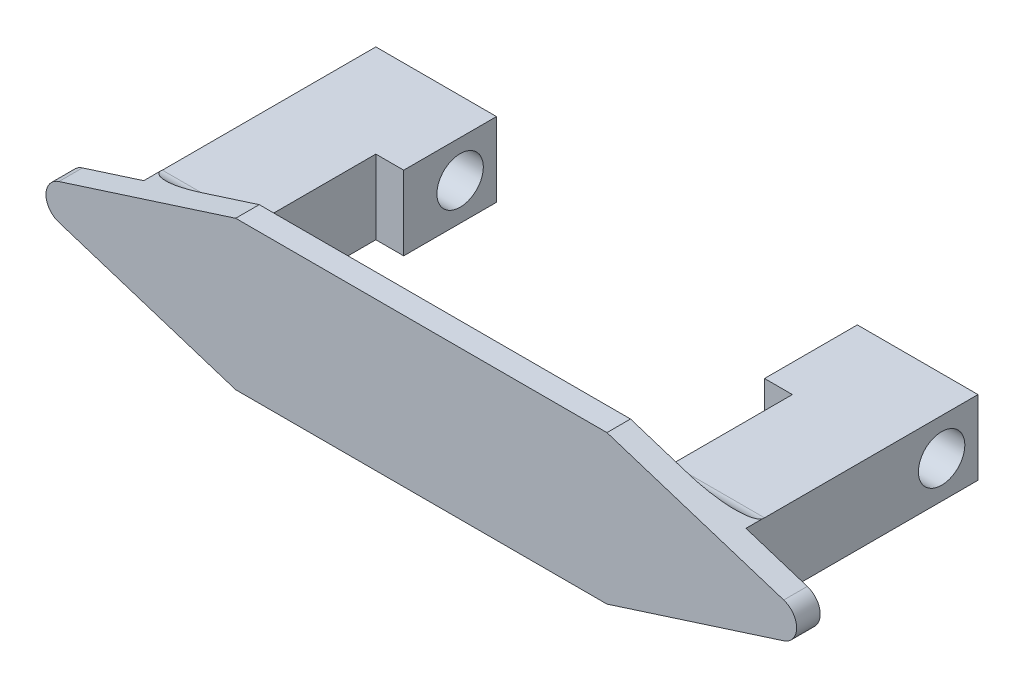
ISO-10303-21;
HEADER;
FILE_DESCRIPTION(('STEP AP214'),'2;1');
FILE_NAME('part.step','',(''),(''),'','','');
FILE_SCHEMA(('AUTOMOTIVE_DESIGN { 1 0 10303 214 1 1 1 1 }'));
ENDSEC;
DATA;
#1=APPLICATION_CONTEXT('core data for automotive mechanical design processes');
#2=APPLICATION_PROTOCOL_DEFINITION('international standard','automotive_design',2000,#1);
#3=PRODUCT_CONTEXT('',#1,'mechanical');
#4=PRODUCT('Part','Part','',(#3));
#5=PRODUCT_RELATED_PRODUCT_CATEGORY('part','',(#4));
#6=PRODUCT_DEFINITION_FORMATION('','',#4);
#7=PRODUCT_DEFINITION_CONTEXT('part definition',#1,'design');
#8=PRODUCT_DEFINITION('design','',#6,#7);
#9=PRODUCT_DEFINITION_SHAPE('','',#8);
#10=(LENGTH_UNIT() NAMED_UNIT(*) SI_UNIT(.MILLI.,.METRE.));
#11=(NAMED_UNIT(*) PLANE_ANGLE_UNIT() SI_UNIT($,.RADIAN.));
#12=(NAMED_UNIT(*) SI_UNIT($,.STERADIAN.) SOLID_ANGLE_UNIT());
#13=UNCERTAINTY_MEASURE_WITH_UNIT(LENGTH_MEASURE(1.E-05),#10,'distance_accuracy_value','');
#14=(GEOMETRIC_REPRESENTATION_CONTEXT(3) GLOBAL_UNCERTAINTY_ASSIGNED_CONTEXT((#13)) GLOBAL_UNIT_ASSIGNED_CONTEXT((#10,
#11,#12)) REPRESENTATION_CONTEXT('',''));
#15=CARTESIAN_POINT('',(0.,0.,0.));
#16=DIRECTION('',(0.,0.,1.));
#17=DIRECTION('',(1.,0.,0.));
#18=AXIS2_PLACEMENT_3D('',#15,#16,#17);
#19=CARTESIAN_POINT('',(0.,0.,-1.27));
#20=DIRECTION('',(0.,0.,-1.));
#21=DIRECTION('',(-1.,0.,0.));
#22=AXIS2_PLACEMENT_3D('',#19,#20,#21);
#23=PLANE('',#22);
#24=DIRECTION('',(0.952424147199324,0.304775727103784,0.));
#25=VECTOR('',#24,1.);
#26=CARTESIAN_POINT('',(45.,0.,-1.27));
#27=LINE('',#26,#25);
#28=CARTESIAN_POINT('',(32.4377976257967,-4.01990475974506,-1.27));
#29=VERTEX_POINT('',#28);
#30=CARTESIAN_POINT('',(39.0473490800042,-1.90484829439864,-1.27));
#31=VERTEX_POINT('',#30);
#32=EDGE_CURVE('E312',#29,#31,#27,.T.);
#33=ORIENTED_EDGE('',*,*,#32,.F.);
#34=DIRECTION('',(0.,-1.,0.));
#35=VECTOR('',#34,1.);
#36=CARTESIAN_POINT('',(32.4377976257967,4.,-1.27));
#37=LINE('',#36,#35);
#38=CARTESIAN_POINT('',(32.4377976257967,4.01990475974507,-1.27));
#39=VERTEX_POINT('',#38);
#40=EDGE_CURVE('E249',#39,#29,#37,.T.);
#41=ORIENTED_EDGE('',*,*,#40,.F.);
#42=DIRECTION('',(-0.952424147199324,0.304775727103784,0.));
#43=VECTOR('',#42,1.);
#44=CARTESIAN_POINT('',(45.,0.,-1.27));
#45=LINE('',#44,#43);
#46=CARTESIAN_POINT('',(39.0473490800042,1.90484829439866,-1.27));
#47=VERTEX_POINT('',#46);
#48=EDGE_CURVE('E316',#47,#39,#45,.T.);
#49=ORIENTED_EDGE('',*,*,#48,.F.);
#50=CARTESIAN_POINT('',(38.4377976257967,0.,-1.27));
#51=DIRECTION('',(0.,0.,-1.));
#52=DIRECTION('',(-1.,0.,0.));
#53=AXIS2_PLACEMENT_3D('',#50,#51,#52);
#54=CIRCLE('',#53,2.);
#55=EDGE_CURVE('E340',#47,#31,#54,.T.);
#56=ORIENTED_EDGE('',*,*,#55,.T.);
#57=EDGE_LOOP('',(#33,#41,#49,#56));
#58=FACE_BOUND('',#57,.T.);
#59=ADVANCED_FACE('F33',(#58),#23,.T.);
#60=DIRECTION('',(0.,-1.,0.));
#61=VECTOR('',#60,1.);
#62=CARTESIAN_POINT('',(-32.4377976257967,4.,-1.27));
#63=LINE('',#62,#61);
#64=CARTESIAN_POINT('',(-32.4377976257967,4.01990475974507,-1.27));
#65=VERTEX_POINT('',#64);
#66=CARTESIAN_POINT('',(-32.4377976257967,-4.01990475974507,-1.27));
#67=VERTEX_POINT('',#66);
#68=EDGE_CURVE('E268',#65,#67,#63,.T.);
#69=ORIENTED_EDGE('',*,*,#68,.T.);
#70=DIRECTION('',(0.952424147199324,-0.304775727103784,0.));
#71=VECTOR('',#70,1.);
#72=CARTESIAN_POINT('',(-45.,0.,-1.27));
#73=LINE('',#72,#71);
#74=CARTESIAN_POINT('',(-39.0473490800042,-1.90484829439865,-1.27));
#75=VERTEX_POINT('',#74);
#76=EDGE_CURVE('E307',#75,#67,#73,.T.);
#77=ORIENTED_EDGE('',*,*,#76,.F.);
#78=CARTESIAN_POINT('',(-38.4377976257967,0.,-1.27));
#79=DIRECTION('',(0.,0.,-1.));
#80=DIRECTION('',(-1.,0.,0.));
#81=AXIS2_PLACEMENT_3D('',#78,#79,#80);
#82=CIRCLE('',#81,2.);
#83=CARTESIAN_POINT('',(-39.0473490800042,1.90484829439865,-1.27));
#84=VERTEX_POINT('',#83);
#85=EDGE_CURVE('E337',#75,#84,#82,.T.);
#86=ORIENTED_EDGE('',*,*,#85,.T.);
#87=DIRECTION('',(-0.952424147199324,-0.304775727103784,0.));
#88=VECTOR('',#87,1.);
#89=CARTESIAN_POINT('',(-45.,0.,-1.27));
#90=LINE('',#89,#88);
#91=EDGE_CURVE('E321',#65,#84,#90,.T.);
#92=ORIENTED_EDGE('',*,*,#91,.F.);
#93=EDGE_LOOP('',(#69,#77,#86,#92));
#94=FACE_BOUND('',#93,.T.);
#95=ADVANCED_FACE('F492',(#94),#23,.T.);
#96=DIRECTION('',(0.,-1.,0.));
#97=VECTOR('',#96,1.);
#98=CARTESIAN_POINT('',(20.4377976257967,0.,-1.27));
#99=LINE('',#98,#97);
#100=CARTESIAN_POINT('',(20.4377976257967,6.,-1.27));
#101=VERTEX_POINT('',#100);
#102=CARTESIAN_POINT('',(20.4377976257967,-6.,-1.27));
#103=VERTEX_POINT('',#102);
#104=EDGE_CURVE('E367',#101,#103,#99,.T.);
#105=ORIENTED_EDGE('',*,*,#104,.T.);
#106=DIRECTION('',(1.,0.,0.));
#107=VECTOR('',#106,1.);
#108=CARTESIAN_POINT('',(32.4377976257967,-6.,-1.27));
#109=LINE('',#108,#107);
#110=CARTESIAN_POINT('',(26.25,-6.,-1.27));
#111=VERTEX_POINT('',#110);
#112=EDGE_CURVE('E369',#103,#111,#109,.T.);
#113=ORIENTED_EDGE('',*,*,#112,.T.);
#114=CARTESIAN_POINT('',(20.,-8.,-1.27));
#115=VERTEX_POINT('',#114);
#116=EDGE_CURVE('E313',#115,#111,#27,.T.);
#117=ORIENTED_EDGE('',*,*,#116,.F.);
#118=DIRECTION('',(1.,0.,0.));
#119=VECTOR('',#118,1.);
#120=CARTESIAN_POINT('',(-20.,-8.00000000000001,-1.27));
#121=LINE('',#120,#119);
#122=CARTESIAN_POINT('',(-20.,-8.00000000000001,-1.27));
#123=VERTEX_POINT('',#122);
#124=EDGE_CURVE('E310',#123,#115,#121,.T.);
#125=ORIENTED_EDGE('',*,*,#124,.F.);
#126=CARTESIAN_POINT('',(-26.25,-6.,-1.27));
#127=VERTEX_POINT('',#126);
#128=EDGE_CURVE('E290',#127,#123,#73,.T.);
#129=ORIENTED_EDGE('',*,*,#128,.F.);
#130=DIRECTION('',(1.,0.,0.));
#131=VECTOR('',#130,1.);
#132=CARTESIAN_POINT('',(-22.4377976257967,-6.,-1.27));
#133=LINE('',#132,#131);
#134=CARTESIAN_POINT('',(-20.4377976257967,-6.,-1.27));
#135=VERTEX_POINT('',#134);
#136=EDGE_CURVE('E363',#127,#135,#133,.T.);
#137=ORIENTED_EDGE('',*,*,#136,.T.);
#138=DIRECTION('',(0.,-1.,0.));
#139=VECTOR('',#138,1.);
#140=CARTESIAN_POINT('',(-20.4377976257967,0.,-1.27));
#141=LINE('',#140,#139);
#142=CARTESIAN_POINT('',(-20.4377976257967,6.,-1.27));
#143=VERTEX_POINT('',#142);
#144=EDGE_CURVE('E354',#135,#143,#141,.F.);
#145=ORIENTED_EDGE('',*,*,#144,.T.);
#146=DIRECTION('',(1.,0.,0.));
#147=VECTOR('',#146,1.);
#148=CARTESIAN_POINT('',(0.,6.,-1.27));
#149=LINE('',#148,#147);
#150=CARTESIAN_POINT('',(-26.25,6.,-1.27));
#151=VERTEX_POINT('',#150);
#152=EDGE_CURVE('E361',#143,#151,#149,.F.);
#153=ORIENTED_EDGE('',*,*,#152,.T.);
#154=CARTESIAN_POINT('',(-20.,8.,-1.27));
#155=VERTEX_POINT('',#154);
#156=EDGE_CURVE('E294',#155,#151,#90,.T.);
#157=ORIENTED_EDGE('',*,*,#156,.F.);
#158=DIRECTION('',(-1.,0.,0.));
#159=VECTOR('',#158,1.);
#160=CARTESIAN_POINT('',(-20.,8.,-1.27));
#161=LINE('',#160,#159);
#162=CARTESIAN_POINT('',(20.,8.,-1.27));
#163=VERTEX_POINT('',#162);
#164=EDGE_CURVE('E319',#163,#155,#161,.T.);
#165=ORIENTED_EDGE('',*,*,#164,.F.);
#166=CARTESIAN_POINT('',(26.25,6.00000000000001,-1.27));
#167=VERTEX_POINT('',#166);
#168=EDGE_CURVE('E315',#167,#163,#45,.T.);
#169=ORIENTED_EDGE('',*,*,#168,.F.);
#170=DIRECTION('',(1.,0.,0.));
#171=VECTOR('',#170,1.);
#172=CARTESIAN_POINT('',(0.,6.,-1.27));
#173=LINE('',#172,#171);
#174=EDGE_CURVE('E365',#167,#101,#173,.F.);
#175=ORIENTED_EDGE('',*,*,#174,.T.);
#176=EDGE_LOOP('',(#105,#113,#117,#125,#129,#137,#145,#153,#157,#165,#169,#175));
#177=FACE_BOUND('',#176,.T.);
#178=ADVANCED_FACE('F426',(#177),#23,.T.);
#179=CARTESIAN_POINT('',(-45.,0.,1.27));
#180=DIRECTION('',(0.304775727103784,0.952424147199324,0.));
#181=DIRECTION('',(-0.952424147199324,0.304775727103784,0.));
#182=AXIS2_PLACEMENT_3D('',#179,#180,#181);
#183=PLANE('',#182);
#184=DIRECTION('',(0.952424147199324,-0.304775727103784,0.));
#185=VECTOR('',#184,1.);
#186=CARTESIAN_POINT('',(-45.,0.,1.27));
#187=LINE('',#186,#185);
#188=CARTESIAN_POINT('',(-39.0473490800042,-1.90484829439865,1.27));
#189=VERTEX_POINT('',#188);
#190=CARTESIAN_POINT('',(-20.,-8.00000000000001,1.27));
#191=VERTEX_POINT('',#190);
#192=EDGE_CURVE('E291',#189,#191,#187,.T.);
#193=ORIENTED_EDGE('',*,*,#192,.F.);
#194=DIRECTION('',(0.,0.,-1.));
#195=VECTOR('',#194,1.);
#196=CARTESIAN_POINT('',(-39.0473490800042,-1.90484829439865,1.27));
#197=LINE('',#196,#195);
#198=EDGE_CURVE('E349',#189,#75,#197,.T.);
#199=ORIENTED_EDGE('',*,*,#198,.T.);
#200=ORIENTED_EDGE('',*,*,#76,.T.);
#201=DIRECTION('',(0.,0.,-1.));
#202=VECTOR('',#201,1.);
#203=CARTESIAN_POINT('',(-32.4377976257967,-4.01990475974507,1.27));
#204=LINE('',#203,#202);
#205=CARTESIAN_POINT('',(-32.4377976257967,-4.01990475974507,-2.98853447898582));
#206=VERTEX_POINT('',#205);
#207=EDGE_CURVE('E400',#67,#206,#204,.T.);
#208=ORIENTED_EDGE('',*,*,#207,.T.);
#209=CARTESIAN_POINT('',(-26.25,-6.,-3.27));
#210=DIRECTION('',(0.304775727103784,0.952424147199324,0.));
#211=DIRECTION('',(-0.952424147199324,0.304775727103784,0.));
#212=AXIS2_PLACEMENT_3D('',#209,#210,#211);
#213=ELLIPSE('',#212,6.56220237420334,2.);
#214=EDGE_CURVE('E390',#206,#127,#213,.T.);
#215=ORIENTED_EDGE('',*,*,#214,.T.);
#216=ORIENTED_EDGE('',*,*,#128,.T.);
#217=DIRECTION('',(0.,0.,-1.));
#218=VECTOR('',#217,1.);
#219=CARTESIAN_POINT('',(-20.,-8.00000000000001,1.27));
#220=LINE('',#219,#218);
#221=EDGE_CURVE('E331',#191,#123,#220,.T.);
#222=ORIENTED_EDGE('',*,*,#221,.F.);
#223=EDGE_LOOP('',(#193,#199,#200,#208,#215,#216,#222));
#224=FACE_BOUND('',#223,.T.);
#225=ADVANCED_FACE('F461',(#224),#183,.F.);
#226=CARTESIAN_POINT('',(-20.,-8.00000000000001,1.27));
#227=DIRECTION('',(0.,1.,0.));
#228=DIRECTION('',(-1.,0.,0.));
#229=AXIS2_PLACEMENT_3D('',#226,#227,#228);
#230=PLANE('',#229);
#231=ORIENTED_EDGE('',*,*,#124,.T.);
#232=DIRECTION('',(0.,0.,-1.));
#233=VECTOR('',#232,1.);
#234=CARTESIAN_POINT('',(20.,-8.,1.27));
#235=LINE('',#234,#233);
#236=CARTESIAN_POINT('',(20.,-8.,1.27));
#237=VERTEX_POINT('',#236);
#238=EDGE_CURVE('E328',#237,#115,#235,.T.);
#239=ORIENTED_EDGE('',*,*,#238,.F.);
#240=DIRECTION('',(1.,0.,0.));
#241=VECTOR('',#240,1.);
#242=CARTESIAN_POINT('',(-20.,-8.00000000000001,1.27));
#243=LINE('',#242,#241);
#244=EDGE_CURVE('E293',#191,#237,#243,.T.);
#245=ORIENTED_EDGE('',*,*,#244,.F.);
#246=ORIENTED_EDGE('',*,*,#221,.T.);
#247=EDGE_LOOP('',(#231,#239,#245,#246));
#248=FACE_BOUND('',#247,.T.);
#249=ADVANCED_FACE('F456',(#248),#230,.F.);
#250=CARTESIAN_POINT('',(45.,0.,1.27));
#251=DIRECTION('',(-0.304775727103784,0.952424147199324,0.));
#252=DIRECTION('',(-0.952424147199324,-0.304775727103784,0.));
#253=AXIS2_PLACEMENT_3D('',#250,#251,#252);
#254=PLANE('',#253);
#255=ORIENTED_EDGE('',*,*,#116,.T.);
#256=CARTESIAN_POINT('',(26.25,-6.,-3.27));
#257=DIRECTION('',(-0.304775727103784,0.952424147199324,0.));
#258=DIRECTION('',(-0.952424147199324,-0.304775727103784,0.));
#259=AXIS2_PLACEMENT_3D('',#256,#257,#258);
#260=ELLIPSE('',#259,6.56220237420334,2.);
#261=CARTESIAN_POINT('',(32.4377976257967,-4.01990475974506,-2.98853447898589));
#262=VERTEX_POINT('',#261);
#263=EDGE_CURVE('E57',#111,#262,#260,.T.);
#264=ORIENTED_EDGE('',*,*,#263,.T.);
#265=DIRECTION('',(0.,0.,1.));
#266=VECTOR('',#265,1.);
#267=CARTESIAN_POINT('',(32.4377976257967,-4.01990475974506,1.27));
#268=LINE('',#267,#266);
#269=EDGE_CURVE('E42',#29,#262,#268,.F.);
#270=ORIENTED_EDGE('',*,*,#269,.F.);
#271=ORIENTED_EDGE('',*,*,#32,.T.);
#272=DIRECTION('',(0.,0.,-1.));
#273=VECTOR('',#272,1.);
#274=CARTESIAN_POINT('',(39.0473490800042,-1.90484829439864,1.27));
#275=LINE('',#274,#273);
#276=CARTESIAN_POINT('',(39.0473490800042,-1.90484829439864,1.27));
#277=VERTEX_POINT('',#276);
#278=EDGE_CURVE('E343',#31,#277,#275,.F.);
#279=ORIENTED_EDGE('',*,*,#278,.T.);
#280=DIRECTION('',(0.952424147199324,0.304775727103784,0.));
#281=VECTOR('',#280,1.);
#282=CARTESIAN_POINT('',(45.,0.,1.27));
#283=LINE('',#282,#281);
#284=EDGE_CURVE('E296',#237,#277,#283,.T.);
#285=ORIENTED_EDGE('',*,*,#284,.F.);
#286=ORIENTED_EDGE('',*,*,#238,.T.);
#287=EDGE_LOOP('',(#255,#264,#270,#271,#279,#285,#286));
#288=FACE_BOUND('',#287,.T.);
#289=ADVANCED_FACE('F451',(#288),#254,.F.);
#290=CARTESIAN_POINT('',(45.,0.,1.27));
#291=DIRECTION('',(-0.304775727103784,-0.952424147199324,0.));
#292=DIRECTION('',(0.952424147199324,-0.304775727103784,0.));
#293=AXIS2_PLACEMENT_3D('',#290,#291,#292);
#294=PLANE('',#293);
#295=DIRECTION('',(-0.952424147199324,0.304775727103784,0.));
#296=VECTOR('',#295,1.);
#297=CARTESIAN_POINT('',(45.,0.,1.27));
#298=LINE('',#297,#296);
#299=CARTESIAN_POINT('',(39.0473490800042,1.90484829439866,1.27));
#300=VERTEX_POINT('',#299);
#301=CARTESIAN_POINT('',(20.,8.,1.27));
#302=VERTEX_POINT('',#301);
#303=EDGE_CURVE('E299',#300,#302,#298,.T.);
#304=ORIENTED_EDGE('',*,*,#303,.F.);
#305=DIRECTION('',(0.,0.,-1.));
#306=VECTOR('',#305,1.);
#307=CARTESIAN_POINT('',(39.0473490800042,1.90484829439866,1.27));
#308=LINE('',#307,#306);
#309=EDGE_CURVE('E334',#300,#47,#308,.T.);
#310=ORIENTED_EDGE('',*,*,#309,.T.);
#311=ORIENTED_EDGE('',*,*,#48,.T.);
#312=DIRECTION('',(0.,0.,-1.));
#313=VECTOR('',#312,1.);
#314=CARTESIAN_POINT('',(32.4377976257967,4.01990475974507,1.27));
#315=LINE('',#314,#313);
#316=CARTESIAN_POINT('',(32.4377976257967,4.01990475974508,-2.98853447898581));
#317=VERTEX_POINT('',#316);
#318=EDGE_CURVE('E398',#39,#317,#315,.T.);
#319=ORIENTED_EDGE('',*,*,#318,.T.);
#320=CARTESIAN_POINT('',(26.25,6.,-3.27));
#321=DIRECTION('',(-0.304775727103784,-0.952424147199324,0.));
#322=DIRECTION('',(0.952424147199324,-0.304775727103784,0.));
#323=AXIS2_PLACEMENT_3D('',#320,#321,#322);
#324=ELLIPSE('',#323,6.56220237420335,2.);
#325=EDGE_CURVE('E388',#317,#167,#324,.T.);
#326=ORIENTED_EDGE('',*,*,#325,.T.);
#327=ORIENTED_EDGE('',*,*,#168,.T.);
#328=DIRECTION('',(0.,0.,-1.));
#329=VECTOR('',#328,1.);
#330=CARTESIAN_POINT('',(20.,8.,1.27));
#331=LINE('',#330,#329);
#332=EDGE_CURVE('E325',#302,#163,#331,.T.);
#333=ORIENTED_EDGE('',*,*,#332,.F.);
#334=EDGE_LOOP('',(#304,#310,#311,#319,#326,#327,#333));
#335=FACE_BOUND('',#334,.T.);
#336=ADVANCED_FACE('F504',(#335),#294,.F.);
#337=CARTESIAN_POINT('',(-20.,8.,1.27));
#338=DIRECTION('',(0.,-1.,0.));
#339=DIRECTION('',(1.,0.,0.));
#340=AXIS2_PLACEMENT_3D('',#337,#338,#339);
#341=PLANE('',#340);
#342=ORIENTED_EDGE('',*,*,#164,.T.);
#343=DIRECTION('',(0.,0.,-1.));
#344=VECTOR('',#343,1.);
#345=CARTESIAN_POINT('',(-20.,8.,1.27));
#346=LINE('',#345,#344);
#347=CARTESIAN_POINT('',(-20.,8.,1.27));
#348=VERTEX_POINT('',#347);
#349=EDGE_CURVE('E306',#348,#155,#346,.T.);
#350=ORIENTED_EDGE('',*,*,#349,.F.);
#351=DIRECTION('',(-1.,0.,0.));
#352=VECTOR('',#351,1.);
#353=CARTESIAN_POINT('',(-20.,8.,1.27));
#354=LINE('',#353,#352);
#355=EDGE_CURVE('E301',#302,#348,#354,.T.);
#356=ORIENTED_EDGE('',*,*,#355,.F.);
#357=ORIENTED_EDGE('',*,*,#332,.T.);
#358=EDGE_LOOP('',(#342,#350,#356,#357));
#359=FACE_BOUND('',#358,.T.);
#360=ADVANCED_FACE('F433',(#359),#341,.F.);
#361=CARTESIAN_POINT('',(-45.,0.,1.27));
#362=DIRECTION('',(0.304775727103784,-0.952424147199324,0.));
#363=DIRECTION('',(0.952424147199324,0.304775727103784,0.));
#364=AXIS2_PLACEMENT_3D('',#361,#362,#363);
#365=PLANE('',#364);
#366=ORIENTED_EDGE('',*,*,#156,.T.);
#367=CARTESIAN_POINT('',(-26.25,6.,-3.27));
#368=DIRECTION('',(0.304775727103784,-0.952424147199324,0.));
#369=DIRECTION('',(0.952424147199324,0.304775727103784,0.));
#370=AXIS2_PLACEMENT_3D('',#367,#368,#369);
#371=ELLIPSE('',#370,6.56220237420334,2.);
#372=CARTESIAN_POINT('',(-32.4377976257967,4.01990475974507,-2.98853447898586));
#373=VERTEX_POINT('',#372);
#374=EDGE_CURVE('E50',#151,#373,#371,.T.);
#375=ORIENTED_EDGE('',*,*,#374,.T.);
#376=DIRECTION('',(0.,0.,1.));
#377=VECTOR('',#376,1.);
#378=CARTESIAN_POINT('',(-32.4377976257967,4.01990475974506,1.27));
#379=LINE('',#378,#377);
#380=EDGE_CURVE('E11',#65,#373,#379,.F.);
#381=ORIENTED_EDGE('',*,*,#380,.F.);
#382=ORIENTED_EDGE('',*,*,#91,.T.);
#383=DIRECTION('',(0.,0.,-1.));
#384=VECTOR('',#383,1.);
#385=CARTESIAN_POINT('',(-39.0473490800042,1.90484829439864,1.27));
#386=LINE('',#385,#384);
#387=CARTESIAN_POINT('',(-39.0473490800042,1.90484829439865,1.27));
#388=VERTEX_POINT('',#387);
#389=EDGE_CURVE('E352',#84,#388,#386,.F.);
#390=ORIENTED_EDGE('',*,*,#389,.T.);
#391=DIRECTION('',(-0.952424147199324,-0.304775727103784,0.));
#392=VECTOR('',#391,1.);
#393=CARTESIAN_POINT('',(-45.,0.,1.27));
#394=LINE('',#393,#392);
#395=EDGE_CURVE('E303',#348,#388,#394,.T.);
#396=ORIENTED_EDGE('',*,*,#395,.F.);
#397=ORIENTED_EDGE('',*,*,#349,.T.);
#398=EDGE_LOOP('',(#366,#375,#381,#382,#390,#396,#397));
#399=FACE_BOUND('',#398,.T.);
#400=ADVANCED_FACE('F428',(#399),#365,.F.);
#401=CARTESIAN_POINT('',(0.,0.,1.27));
#402=DIRECTION('',(0.,0.,-1.));
#403=DIRECTION('',(-1.,0.,0.));
#404=AXIS2_PLACEMENT_3D('',#401,#402,#403);
#405=PLANE('',#404);
#406=ORIENTED_EDGE('',*,*,#284,.T.);
#407=CARTESIAN_POINT('',(38.4377976257967,0.,1.27));
#408=DIRECTION('',(0.,0.,-1.));
#409=DIRECTION('',(-1.,0.,0.));
#410=AXIS2_PLACEMENT_3D('',#407,#408,#409);
#411=CIRCLE('',#410,2.);
#412=EDGE_CURVE('E347',#277,#300,#411,.F.);
#413=ORIENTED_EDGE('',*,*,#412,.T.);
#414=ORIENTED_EDGE('',*,*,#303,.T.);
#415=ORIENTED_EDGE('',*,*,#355,.T.);
#416=ORIENTED_EDGE('',*,*,#395,.T.);
#417=CARTESIAN_POINT('',(-38.4377976257967,0.,1.27));
#418=DIRECTION('',(0.,0.,-1.));
#419=DIRECTION('',(-1.,0.,0.));
#420=AXIS2_PLACEMENT_3D('',#417,#418,#419);
#421=CIRCLE('',#420,2.);
#422=EDGE_CURVE('E345',#388,#189,#421,.F.);
#423=ORIENTED_EDGE('',*,*,#422,.T.);
#424=ORIENTED_EDGE('',*,*,#192,.T.);
#425=ORIENTED_EDGE('',*,*,#244,.T.);
#426=EDGE_LOOP('',(#406,#413,#414,#415,#416,#423,#424,#425));
#427=FACE_BOUND('',#426,.T.);
#428=ADVANCED_FACE('F500',(#427),#405,.F.);
#429=CARTESIAN_POINT('',(38.4377976257967,0.,1.27));
#430=DIRECTION('',(0.,0.,-1.));
#431=DIRECTION('',(-1.,0.,0.));
#432=AXIS2_PLACEMENT_3D('',#429,#430,#431);
#433=CYLINDRICAL_SURFACE('',#432,2.);
#434=ORIENTED_EDGE('',*,*,#412,.F.);
#435=ORIENTED_EDGE('',*,*,#278,.F.);
#436=ORIENTED_EDGE('',*,*,#55,.F.);
#437=ORIENTED_EDGE('',*,*,#309,.F.);
#438=EDGE_LOOP('',(#434,#435,#436,#437));
#439=FACE_BOUND('',#438,.T.);
#440=ADVANCED_FACE('F532',(#439),#433,.T.);
#441=CARTESIAN_POINT('',(-38.4377976257967,0.,1.27));
#442=DIRECTION('',(0.,0.,-1.));
#443=DIRECTION('',(-1.,0.,0.));
#444=AXIS2_PLACEMENT_3D('',#441,#442,#443);
#445=CYLINDRICAL_SURFACE('',#444,2.);
#446=ORIENTED_EDGE('',*,*,#422,.F.);
#447=ORIENTED_EDGE('',*,*,#389,.F.);
#448=ORIENTED_EDGE('',*,*,#85,.F.);
#449=ORIENTED_EDGE('',*,*,#198,.F.);
#450=EDGE_LOOP('',(#446,#447,#448,#449));
#451=FACE_BOUND('',#450,.T.);
#452=ADVANCED_FACE('F498',(#451),#445,.T.);
#453=CARTESIAN_POINT('',(-22.4377976257967,4.,-16.27));
#454=DIRECTION('',(-1.,0.,0.));
#455=DIRECTION('',(0.,0.,1.));
#456=AXIS2_PLACEMENT_3D('',#453,#454,#455);
#457=PLANE('',#456);
#458=DIRECTION('',(0.,0.,-1.));
#459=VECTOR('',#458,1.);
#460=CARTESIAN_POINT('',(-22.4377976257967,4.,-16.27));
#461=LINE('',#460,#459);
#462=CARTESIAN_POINT('',(-22.4377976257967,4.,-3.27));
#463=VERTEX_POINT('',#462);
#464=CARTESIAN_POINT('',(-22.4377976257967,4.,-16.27));
#465=VERTEX_POINT('',#464);
#466=EDGE_CURVE('E257',#463,#465,#461,.T.);
#467=ORIENTED_EDGE('',*,*,#466,.F.);
#468=DIRECTION('',(0.,-1.,0.));
#469=VECTOR('',#468,1.);
#470=CARTESIAN_POINT('',(-22.4377976257967,4.,-3.27));
#471=LINE('',#470,#469);
#472=CARTESIAN_POINT('',(-22.4377976257967,-4.,-3.27));
#473=VERTEX_POINT('',#472);
#474=EDGE_CURVE('E381',#463,#473,#471,.T.);
#475=ORIENTED_EDGE('',*,*,#474,.T.);
#476=DIRECTION('',(0.,0.,-1.));
#477=VECTOR('',#476,1.);
#478=CARTESIAN_POINT('',(-22.4377976257967,-4.,-16.27));
#479=LINE('',#478,#477);
#480=CARTESIAN_POINT('',(-22.4377976257967,-4.,-16.27));
#481=VERTEX_POINT('',#480);
#482=EDGE_CURVE('E248',#473,#481,#479,.T.);
#483=ORIENTED_EDGE('',*,*,#482,.T.);
#484=DIRECTION('',(0.,-1.,0.));
#485=VECTOR('',#484,1.);
#486=CARTESIAN_POINT('',(-22.4377976257967,4.,-16.27));
#487=LINE('',#486,#485);
#488=EDGE_CURVE('E287',#465,#481,#487,.T.);
#489=ORIENTED_EDGE('',*,*,#488,.F.);
#490=EDGE_LOOP('',(#467,#475,#483,#489));
#491=FACE_BOUND('',#490,.T.);
#492=ADVANCED_FACE('F480',(#491),#457,.F.);
#493=CARTESIAN_POINT('',(-19.4377976257967,4.,-16.27));
#494=DIRECTION('',(0.,0.,-1.));
#495=DIRECTION('',(-1.,0.,0.));
#496=AXIS2_PLACEMENT_3D('',#493,#494,#495);
#497=PLANE('',#496);
#498=DIRECTION('',(1.,0.,0.));
#499=VECTOR('',#498,1.);
#500=CARTESIAN_POINT('',(-19.4377976257967,-4.,-16.27));
#501=LINE('',#500,#499);
#502=CARTESIAN_POINT('',(-19.4377976257967,-4.,-16.27));
#503=VERTEX_POINT('',#502);
#504=EDGE_CURVE('E251',#481,#503,#501,.T.);
#505=ORIENTED_EDGE('',*,*,#504,.T.);
#506=DIRECTION('',(0.,-1.,0.));
#507=VECTOR('',#506,1.);
#508=CARTESIAN_POINT('',(-19.4377976257967,4.,-16.27));
#509=LINE('',#508,#507);
#510=CARTESIAN_POINT('',(-19.4377976257967,4.,-16.27));
#511=VERTEX_POINT('',#510);
#512=EDGE_CURVE('E284',#511,#503,#509,.T.);
#513=ORIENTED_EDGE('',*,*,#512,.F.);
#514=DIRECTION('',(1.,0.,0.));
#515=VECTOR('',#514,1.);
#516=CARTESIAN_POINT('',(-19.4377976257967,4.,-16.27));
#517=LINE('',#516,#515);
#518=EDGE_CURVE('E259',#465,#511,#517,.T.);
#519=ORIENTED_EDGE('',*,*,#518,.F.);
#520=ORIENTED_EDGE('',*,*,#488,.T.);
#521=EDGE_LOOP('',(#505,#513,#519,#520));
#522=FACE_BOUND('',#521,.T.);
#523=ADVANCED_FACE('F483',(#522),#497,.F.);
#524=CARTESIAN_POINT('',(-19.4377976257967,4.,-26.27));
#525=DIRECTION('',(-1.,0.,0.));
#526=DIRECTION('',(0.,0.,1.));
#527=AXIS2_PLACEMENT_3D('',#524,#525,#526);
#528=PLANE('',#527);
#529=CARTESIAN_POINT('',(-19.4377976257967,0.,-22.3503511113354));
#530=DIRECTION('',(-1.,0.,0.));
#531=DIRECTION('',(0.,0.,1.));
#532=AXIS2_PLACEMENT_3D('',#529,#530,#531);
#533=CIRCLE('',#532,2.5);
#534=CARTESIAN_POINT('',(-19.4377976257967,0.,-19.8503511113354));
#535=VERTEX_POINT('',#534);
#536=EDGE_CURVE('E797',#535,#535,#533,.T.);
#537=ORIENTED_EDGE('',*,*,#536,.T.);
#538=EDGE_LOOP('',(#537));
#539=FACE_BOUND('',#538,.T.);
#540=DIRECTION('',(0.,0.,-1.));
#541=VECTOR('',#540,1.);
#542=CARTESIAN_POINT('',(-19.4377976257967,-4.,-26.27));
#543=LINE('',#542,#541);
#544=CARTESIAN_POINT('',(-19.4377976257967,-4.,-26.27));
#545=VERTEX_POINT('',#544);
#546=EDGE_CURVE('E271',#503,#545,#543,.T.);
#547=ORIENTED_EDGE('',*,*,#546,.T.);
#548=DIRECTION('',(0.,-1.,0.));
#549=VECTOR('',#548,1.);
#550=CARTESIAN_POINT('',(-19.4377976257967,4.,-26.27));
#551=LINE('',#550,#549);
#552=CARTESIAN_POINT('',(-19.4377976257967,4.,-26.27));
#553=VERTEX_POINT('',#552);
#554=EDGE_CURVE('E281',#553,#545,#551,.T.);
#555=ORIENTED_EDGE('',*,*,#554,.F.);
#556=DIRECTION('',(0.,0.,-1.));
#557=VECTOR('',#556,1.);
#558=CARTESIAN_POINT('',(-19.4377976257967,4.,-26.27));
#559=LINE('',#558,#557);
#560=EDGE_CURVE('E262',#511,#553,#559,.T.);
#561=ORIENTED_EDGE('',*,*,#560,.F.);
#562=ORIENTED_EDGE('',*,*,#512,.T.);
#563=EDGE_LOOP('',(#547,#555,#561,#562));
#564=FACE_BOUND('',#563,.T.);
#565=ADVANCED_FACE('F657',(#539,#564),#528,.F.);
#566=CARTESIAN_POINT('',(-32.4377976257967,4.,-26.27));
#567=DIRECTION('',(0.,0.,1.));
#568=DIRECTION('',(1.,0.,0.));
#569=AXIS2_PLACEMENT_3D('',#566,#567,#568);
#570=PLANE('',#569);
#571=DIRECTION('',(-1.,0.,0.));
#572=VECTOR('',#571,1.);
#573=CARTESIAN_POINT('',(-32.4377976257967,-4.,-26.27));
#574=LINE('',#573,#572);
#575=CARTESIAN_POINT('',(-32.4377976257967,-4.,-26.27));
#576=VERTEX_POINT('',#575);
#577=EDGE_CURVE('E273',#545,#576,#574,.T.);
#578=ORIENTED_EDGE('',*,*,#577,.T.);
#579=DIRECTION('',(0.,-1.,0.));
#580=VECTOR('',#579,1.);
#581=CARTESIAN_POINT('',(-32.4377976257967,4.,-26.27));
#582=LINE('',#581,#580);
#583=CARTESIAN_POINT('',(-32.4377976257967,4.,-26.27));
#584=VERTEX_POINT('',#583);
#585=EDGE_CURVE('E278',#584,#576,#582,.T.);
#586=ORIENTED_EDGE('',*,*,#585,.F.);
#587=DIRECTION('',(-1.,0.,0.));
#588=VECTOR('',#587,1.);
#589=CARTESIAN_POINT('',(-32.4377976257967,4.,-26.27));
#590=LINE('',#589,#588);
#591=EDGE_CURVE('E264',#553,#584,#590,.T.);
#592=ORIENTED_EDGE('',*,*,#591,.F.);
#593=ORIENTED_EDGE('',*,*,#554,.T.);
#594=EDGE_LOOP('',(#578,#586,#592,#593));
#595=FACE_BOUND('',#594,.T.);
#596=ADVANCED_FACE('F649',(#595),#570,.F.);
#597=CARTESIAN_POINT('',(-32.4377976257967,4.,-1.27));
#598=DIRECTION('',(1.,0.,0.));
#599=DIRECTION('',(0.,0.,-1.));
#600=AXIS2_PLACEMENT_3D('',#597,#598,#599);
#601=PLANE('',#600);
#602=CARTESIAN_POINT('',(-32.4377976257967,0.,-22.3503511113354));
#603=DIRECTION('',(1.,0.,0.));
#604=DIRECTION('',(0.,0.,-1.));
#605=AXIS2_PLACEMENT_3D('',#602,#603,#604);
#606=CIRCLE('',#605,2.5);
#607=CARTESIAN_POINT('',(-32.4377976257967,0.,-24.8503511113354));
#608=VERTEX_POINT('',#607);
#609=EDGE_CURVE('E799',#608,#608,#606,.T.);
#610=ORIENTED_EDGE('',*,*,#609,.T.);
#611=EDGE_LOOP('',(#610));
#612=FACE_BOUND('',#611,.T.);
#613=DIRECTION('',(0.,0.,1.));
#614=VECTOR('',#613,1.);
#615=CARTESIAN_POINT('',(-32.4377976257967,-4.,-1.27));
#616=LINE('',#615,#614);
#617=CARTESIAN_POINT('',(-32.4377976257967,-4.,-3.27));
#618=VERTEX_POINT('',#617);
#619=EDGE_CURVE('E260',#576,#618,#616,.T.);
#620=ORIENTED_EDGE('',*,*,#619,.T.);
#621=CARTESIAN_POINT('',(-32.4377976257967,-6.,-3.27));
#622=DIRECTION('',(1.,0.,0.));
#623=DIRECTION('',(0.,0.,-1.));
#624=AXIS2_PLACEMENT_3D('',#621,#622,#623);
#625=CIRCLE('',#624,2.);
#626=EDGE_CURVE('E393',#618,#206,#625,.T.);
#627=ORIENTED_EDGE('',*,*,#626,.T.);
#628=ORIENTED_EDGE('',*,*,#207,.F.);
#629=ORIENTED_EDGE('',*,*,#68,.F.);
#630=ORIENTED_EDGE('',*,*,#380,.T.);
#631=CARTESIAN_POINT('',(-32.4377976257967,6.,-3.27));
#632=DIRECTION('',(1.,0.,0.));
#633=DIRECTION('',(0.,0.,-1.));
#634=AXIS2_PLACEMENT_3D('',#631,#632,#633);
#635=CIRCLE('',#634,2.);
#636=CARTESIAN_POINT('',(-32.4377976257967,4.,-3.27));
#637=VERTEX_POINT('',#636);
#638=EDGE_CURVE('E396',#373,#637,#635,.T.);
#639=ORIENTED_EDGE('',*,*,#638,.T.);
#640=DIRECTION('',(0.,0.,1.));
#641=VECTOR('',#640,1.);
#642=CARTESIAN_POINT('',(-32.4377976257967,4.,-1.27));
#643=LINE('',#642,#641);
#644=EDGE_CURVE('E266',#584,#637,#643,.T.);
#645=ORIENTED_EDGE('',*,*,#644,.F.);
#646=ORIENTED_EDGE('',*,*,#585,.T.);
#647=EDGE_LOOP('',(#620,#627,#628,#629,#630,#639,#645,#646));
#648=FACE_BOUND('',#647,.T.);
#649=ADVANCED_FACE('F467',(#612,#648),#601,.F.);
#650=CARTESIAN_POINT('',(0.,4.,0.));
#651=DIRECTION('',(0.,-1.,0.));
#652=DIRECTION('',(0.,0.,-1.));
#653=AXIS2_PLACEMENT_3D('',#650,#651,#652);
#654=PLANE('',#653);
#655=ORIENTED_EDGE('',*,*,#644,.T.);
#656=DIRECTION('',(1.,0.,0.));
#657=VECTOR('',#656,1.);
#658=CARTESIAN_POINT('',(0.,4.,-3.27));
#659=LINE('',#658,#657);
#660=EDGE_CURVE('E379',#637,#463,#659,.T.);
#661=ORIENTED_EDGE('',*,*,#660,.T.);
#662=ORIENTED_EDGE('',*,*,#466,.T.);
#663=ORIENTED_EDGE('',*,*,#518,.T.);
#664=ORIENTED_EDGE('',*,*,#560,.T.);
#665=ORIENTED_EDGE('',*,*,#591,.T.);
#666=EDGE_LOOP('',(#655,#661,#662,#663,#664,#665));
#667=FACE_BOUND('',#666,.T.);
#668=ADVANCED_FACE('F487',(#667),#654,.F.);
#669=CARTESIAN_POINT('',(0.,-4.,0.));
#670=DIRECTION('',(0.,-1.,0.));
#671=DIRECTION('',(0.,0.,-1.));
#672=AXIS2_PLACEMENT_3D('',#669,#670,#671);
#673=PLANE('',#672);
#674=ORIENTED_EDGE('',*,*,#482,.F.);
#675=DIRECTION('',(1.,0.,0.));
#676=VECTOR('',#675,1.);
#677=CARTESIAN_POINT('',(-32.4377976257967,-4.,-3.27));
#678=LINE('',#677,#676);
#679=EDGE_CURVE('E377',#473,#618,#678,.F.);
#680=ORIENTED_EDGE('',*,*,#679,.T.);
#681=ORIENTED_EDGE('',*,*,#619,.F.);
#682=ORIENTED_EDGE('',*,*,#577,.F.);
#683=ORIENTED_EDGE('',*,*,#546,.F.);
#684=ORIENTED_EDGE('',*,*,#504,.F.);
#685=EDGE_LOOP('',(#674,#680,#681,#682,#683,#684));
#686=FACE_BOUND('',#685,.T.);
#687=ADVANCED_FACE('F474',(#686),#673,.T.);
#688=CARTESIAN_POINT('',(19.4377976257967,4.,-16.27));
#689=DIRECTION('',(0.,0.,-1.));
#690=DIRECTION('',(-1.,0.,0.));
#691=AXIS2_PLACEMENT_3D('',#688,#689,#690);
#692=PLANE('',#691);
#693=DIRECTION('',(1.,0.,0.));
#694=VECTOR('',#693,1.);
#695=CARTESIAN_POINT('',(19.4377976257967,-4.,-16.27));
#696=LINE('',#695,#694);
#697=CARTESIAN_POINT('',(19.4377976257967,-4.,-16.27));
#698=VERTEX_POINT('',#697);
#699=CARTESIAN_POINT('',(22.4377976257967,-4.,-16.27));
#700=VERTEX_POINT('',#699);
#701=EDGE_CURVE('E247',#698,#700,#696,.T.);
#702=ORIENTED_EDGE('',*,*,#701,.T.);
#703=DIRECTION('',(0.,-1.,0.));
#704=VECTOR('',#703,1.);
#705=CARTESIAN_POINT('',(22.4377976257967,4.,-16.27));
#706=LINE('',#705,#704);
#707=CARTESIAN_POINT('',(22.4377976257967,4.,-16.27));
#708=VERTEX_POINT('',#707);
#709=EDGE_CURVE('E227',#708,#700,#706,.T.);
#710=ORIENTED_EDGE('',*,*,#709,.F.);
#711=DIRECTION('',(1.,0.,0.));
#712=VECTOR('',#711,1.);
#713=CARTESIAN_POINT('',(19.4377976257967,4.,-16.27));
#714=LINE('',#713,#712);
#715=CARTESIAN_POINT('',(19.4377976257967,4.,-16.27));
#716=VERTEX_POINT('',#715);
#717=EDGE_CURVE('E234',#716,#708,#714,.T.);
#718=ORIENTED_EDGE('',*,*,#717,.F.);
#719=DIRECTION('',(0.,-1.,0.));
#720=VECTOR('',#719,1.);
#721=CARTESIAN_POINT('',(19.4377976257967,4.,-16.27));
#722=LINE('',#721,#720);
#723=EDGE_CURVE('E810',#716,#698,#722,.T.);
#724=ORIENTED_EDGE('',*,*,#723,.T.);
#725=EDGE_LOOP('',(#702,#710,#718,#724));
#726=FACE_BOUND('',#725,.T.);
#727=ADVANCED_FACE('F245',(#726),#692,.F.);
#728=CARTESIAN_POINT('',(22.4377976257967,4.,-16.27));
#729=DIRECTION('',(1.,0.,0.));
#730=DIRECTION('',(0.,0.,-1.));
#731=AXIS2_PLACEMENT_3D('',#728,#729,#730);
#732=PLANE('',#731);
#733=DIRECTION('',(0.,0.,1.));
#734=VECTOR('',#733,1.);
#735=CARTESIAN_POINT('',(22.4377976257967,-4.,-16.27));
#736=LINE('',#735,#734);
#737=CARTESIAN_POINT('',(22.4377976257967,-4.,-3.27));
#738=VERTEX_POINT('',#737);
#739=EDGE_CURVE('E801',#700,#738,#736,.T.);
#740=ORIENTED_EDGE('',*,*,#739,.T.);
#741=DIRECTION('',(0.,-1.,0.));
#742=VECTOR('',#741,1.);
#743=CARTESIAN_POINT('',(22.4377976257967,4.,-3.27));
#744=LINE('',#743,#742);
#745=CARTESIAN_POINT('',(22.4377976257967,4.,-3.27));
#746=VERTEX_POINT('',#745);
#747=EDGE_CURVE('E230',#738,#746,#744,.F.);
#748=ORIENTED_EDGE('',*,*,#747,.T.);
#749=DIRECTION('',(0.,0.,1.));
#750=VECTOR('',#749,1.);
#751=CARTESIAN_POINT('',(22.4377976257967,4.,-16.27));
#752=LINE('',#751,#750);
#753=EDGE_CURVE('E222',#708,#746,#752,.T.);
#754=ORIENTED_EDGE('',*,*,#753,.F.);
#755=ORIENTED_EDGE('',*,*,#709,.T.);
#756=EDGE_LOOP('',(#740,#748,#754,#755));
#757=FACE_BOUND('',#756,.T.);
#758=ADVANCED_FACE('F225',(#757),#732,.F.);
#759=CARTESIAN_POINT('',(32.4377976257967,4.,-1.27));
#760=DIRECTION('',(-1.,0.,0.));
#761=DIRECTION('',(0.,0.,1.));
#762=AXIS2_PLACEMENT_3D('',#759,#760,#761);
#763=PLANE('',#762);
#764=CARTESIAN_POINT('',(32.4377976257967,0.,-22.3503511113354));
#765=DIRECTION('',(-1.,0.,0.));
#766=DIRECTION('',(0.,0.,1.));
#767=AXIS2_PLACEMENT_3D('',#764,#765,#766);
#768=CIRCLE('',#767,2.5);
#769=CARTESIAN_POINT('',(32.4377976257967,0.,-19.8503511113354));
#770=VERTEX_POINT('',#769);
#771=EDGE_CURVE('E358',#770,#770,#768,.T.);
#772=ORIENTED_EDGE('',*,*,#771,.T.);
#773=EDGE_LOOP('',(#772));
#774=FACE_BOUND('',#773,.T.);
#775=ORIENTED_EDGE('',*,*,#40,.T.);
#776=ORIENTED_EDGE('',*,*,#269,.T.);
#777=CARTESIAN_POINT('',(32.4377976257967,-6.,-3.27));
#778=DIRECTION('',(-1.,0.,0.));
#779=DIRECTION('',(0.,0.,1.));
#780=AXIS2_PLACEMENT_3D('',#777,#778,#779);
#781=CIRCLE('',#780,2.);
#782=CARTESIAN_POINT('',(32.4377976257967,-4.,-3.27));
#783=VERTEX_POINT('',#782);
#784=EDGE_CURVE('E384',#262,#783,#781,.T.);
#785=ORIENTED_EDGE('',*,*,#784,.T.);
#786=DIRECTION('',(0.,0.,-1.));
#787=VECTOR('',#786,1.);
#788=CARTESIAN_POINT('',(32.4377976257967,-4.,-1.27));
#789=LINE('',#788,#787);
#790=CARTESIAN_POINT('',(32.4377976257967,-4.,-26.27));
#791=VERTEX_POINT('',#790);
#792=EDGE_CURVE('E813',#783,#791,#789,.T.);
#793=ORIENTED_EDGE('',*,*,#792,.T.);
#794=DIRECTION('',(0.,-1.,0.));
#795=VECTOR('',#794,1.);
#796=CARTESIAN_POINT('',(32.4377976257967,4.,-26.27));
#797=LINE('',#796,#795);
#798=CARTESIAN_POINT('',(32.4377976257967,4.,-26.27));
#799=VERTEX_POINT('',#798);
#800=EDGE_CURVE('E253',#799,#791,#797,.T.);
#801=ORIENTED_EDGE('',*,*,#800,.F.);
#802=DIRECTION('',(0.,0.,-1.));
#803=VECTOR('',#802,1.);
#804=CARTESIAN_POINT('',(32.4377976257967,4.,-1.27));
#805=LINE('',#804,#803);
#806=CARTESIAN_POINT('',(32.4377976257967,4.,-3.27));
#807=VERTEX_POINT('',#806);
#808=EDGE_CURVE('E233',#807,#799,#805,.T.);
#809=ORIENTED_EDGE('',*,*,#808,.F.);
#810=CARTESIAN_POINT('',(32.4377976257967,6.,-3.27));
#811=DIRECTION('',(-1.,0.,0.));
#812=DIRECTION('',(0.,0.,1.));
#813=AXIS2_PLACEMENT_3D('',#810,#811,#812);
#814=CIRCLE('',#813,2.);
#815=EDGE_CURVE('E386',#807,#317,#814,.T.);
#816=ORIENTED_EDGE('',*,*,#815,.T.);
#817=ORIENTED_EDGE('',*,*,#318,.F.);
#818=EDGE_LOOP('',(#775,#776,#785,#793,#801,#809,#816,#817));
#819=FACE_BOUND('',#818,.T.);
#820=ADVANCED_FACE('F610',(#774,#819),#763,.F.);
#821=CARTESIAN_POINT('',(32.4377976257967,4.,-26.27));
#822=DIRECTION('',(0.,0.,1.));
#823=DIRECTION('',(1.,0.,0.));
#824=AXIS2_PLACEMENT_3D('',#821,#822,#823);
#825=PLANE('',#824);
#826=DIRECTION('',(-1.,0.,0.));
#827=VECTOR('',#826,1.);
#828=CARTESIAN_POINT('',(32.4377976257967,-4.,-26.27));
#829=LINE('',#828,#827);
#830=CARTESIAN_POINT('',(19.4377976257967,-4.,-26.27));
#831=VERTEX_POINT('',#830);
#832=EDGE_CURVE('E815',#791,#831,#829,.T.);
#833=ORIENTED_EDGE('',*,*,#832,.T.);
#834=DIRECTION('',(0.,-1.,0.));
#835=VECTOR('',#834,1.);
#836=CARTESIAN_POINT('',(19.4377976257967,4.,-26.27));
#837=LINE('',#836,#835);
#838=CARTESIAN_POINT('',(19.4377976257967,4.,-26.27));
#839=VERTEX_POINT('',#838);
#840=EDGE_CURVE('E819',#839,#831,#837,.T.);
#841=ORIENTED_EDGE('',*,*,#840,.F.);
#842=DIRECTION('',(-1.,0.,0.));
#843=VECTOR('',#842,1.);
#844=CARTESIAN_POINT('',(32.4377976257967,4.,-26.27));
#845=LINE('',#844,#843);
#846=EDGE_CURVE('E808',#799,#839,#845,.T.);
#847=ORIENTED_EDGE('',*,*,#846,.F.);
#848=ORIENTED_EDGE('',*,*,#800,.T.);
#849=EDGE_LOOP('',(#833,#841,#847,#848));
#850=FACE_BOUND('',#849,.T.);
#851=ADVANCED_FACE('F601',(#850),#825,.F.);
#852=CARTESIAN_POINT('',(19.4377976257967,4.,-26.27));
#853=DIRECTION('',(1.,0.,0.));
#854=DIRECTION('',(0.,0.,-1.));
#855=AXIS2_PLACEMENT_3D('',#852,#853,#854);
#856=PLANE('',#855);
#857=CARTESIAN_POINT('',(19.4377976257967,0.,-22.3503511113354));
#858=DIRECTION('',(1.,0.,0.));
#859=DIRECTION('',(0.,0.,-1.));
#860=AXIS2_PLACEMENT_3D('',#857,#858,#859);
#861=CIRCLE('',#860,2.5);
#862=CARTESIAN_POINT('',(19.4377976257967,0.,-24.8503511113354));
#863=VERTEX_POINT('',#862);
#864=EDGE_CURVE('E355',#863,#863,#861,.T.);
#865=ORIENTED_EDGE('',*,*,#864,.T.);
#866=EDGE_LOOP('',(#865));
#867=FACE_BOUND('',#866,.T.);
#868=DIRECTION('',(0.,0.,1.));
#869=VECTOR('',#868,1.);
#870=CARTESIAN_POINT('',(19.4377976257967,-4.,-26.27));
#871=LINE('',#870,#869);
#872=EDGE_CURVE('E243',#831,#698,#871,.T.);
#873=ORIENTED_EDGE('',*,*,#872,.T.);
#874=ORIENTED_EDGE('',*,*,#723,.F.);
#875=DIRECTION('',(0.,0.,1.));
#876=VECTOR('',#875,1.);
#877=CARTESIAN_POINT('',(19.4377976257967,4.,-26.27));
#878=LINE('',#877,#876);
#879=EDGE_CURVE('E239',#839,#716,#878,.T.);
#880=ORIENTED_EDGE('',*,*,#879,.F.);
#881=ORIENTED_EDGE('',*,*,#840,.T.);
#882=EDGE_LOOP('',(#873,#874,#880,#881));
#883=FACE_BOUND('',#882,.T.);
#884=ADVANCED_FACE('F594',(#867,#883),#856,.F.);
#885=CARTESIAN_POINT('',(0.,4.,0.));
#886=DIRECTION('',(0.,-1.,0.));
#887=DIRECTION('',(0.,0.,-1.));
#888=AXIS2_PLACEMENT_3D('',#885,#886,#887);
#889=PLANE('',#888);
#890=ORIENTED_EDGE('',*,*,#753,.T.);
#891=DIRECTION('',(1.,0.,0.));
#892=VECTOR('',#891,1.);
#893=CARTESIAN_POINT('',(0.,4.,-3.27));
#894=LINE('',#893,#892);
#895=EDGE_CURVE('E375',#746,#807,#894,.T.);
#896=ORIENTED_EDGE('',*,*,#895,.T.);
#897=ORIENTED_EDGE('',*,*,#808,.T.);
#898=ORIENTED_EDGE('',*,*,#846,.T.);
#899=ORIENTED_EDGE('',*,*,#879,.T.);
#900=ORIENTED_EDGE('',*,*,#717,.T.);
#901=EDGE_LOOP('',(#890,#896,#897,#898,#899,#900));
#902=FACE_BOUND('',#901,.T.);
#903=ADVANCED_FACE('F237',(#902),#889,.F.);
#904=CARTESIAN_POINT('',(0.,-4.,0.));
#905=DIRECTION('',(0.,-1.,0.));
#906=DIRECTION('',(0.,0.,-1.));
#907=AXIS2_PLACEMENT_3D('',#904,#905,#906);
#908=PLANE('',#907);
#909=ORIENTED_EDGE('',*,*,#792,.F.);
#910=DIRECTION('',(1.,0.,0.));
#911=VECTOR('',#910,1.);
#912=CARTESIAN_POINT('',(22.4377976257967,-4.,-3.27));
#913=LINE('',#912,#911);
#914=EDGE_CURVE('E372',#783,#738,#913,.F.);
#915=ORIENTED_EDGE('',*,*,#914,.T.);
#916=ORIENTED_EDGE('',*,*,#739,.F.);
#917=ORIENTED_EDGE('',*,*,#701,.F.);
#918=ORIENTED_EDGE('',*,*,#872,.F.);
#919=ORIENTED_EDGE('',*,*,#832,.F.);
#920=EDGE_LOOP('',(#909,#915,#916,#917,#918,#919));
#921=FACE_BOUND('',#920,.T.);
#922=ADVANCED_FACE('F580',(#921),#908,.T.);
#923=CARTESIAN_POINT('',(-40.4377976257967,0.,-22.3503511113354));
#924=DIRECTION('',(1.,0.,0.));
#925=DIRECTION('',(0.,0.,-1.));
#926=AXIS2_PLACEMENT_3D('',#923,#924,#925);
#927=CYLINDRICAL_SURFACE('',#926,2.5);
#928=ORIENTED_EDGE('',*,*,#864,.F.);
#929=EDGE_LOOP('',(#928));
#930=FACE_BOUND('',#929,.T.);
#931=ORIENTED_EDGE('',*,*,#771,.F.);
#932=EDGE_LOOP('',(#931));
#933=FACE_BOUND('',#932,.T.);
#934=ADVANCED_FACE('F572',(#930,#933),#927,.F.);
#935=ORIENTED_EDGE('',*,*,#609,.F.);
#936=EDGE_LOOP('',(#935));
#937=FACE_BOUND('',#936,.T.);
#938=ORIENTED_EDGE('',*,*,#536,.F.);
#939=EDGE_LOOP('',(#938));
#940=FACE_BOUND('',#939,.T.);
#941=ADVANCED_FACE('F545',(#937,#940),#927,.F.);
#942=CARTESIAN_POINT('',(0.,6.,-3.27));
#943=DIRECTION('',(1.,0.,0.));
#944=DIRECTION('',(0.,0.,-1.));
#945=AXIS2_PLACEMENT_3D('',#942,#943,#944);
#946=CYLINDRICAL_SURFACE('',#945,2.);
#947=ORIENTED_EDGE('',*,*,#815,.F.);
#948=ORIENTED_EDGE('',*,*,#895,.F.);
#949=CARTESIAN_POINT('',(20.4377976257967,6.,-3.27));
#950=DIRECTION('',(0.707106781186547,0.707106781186547,0.));
#951=DIRECTION('',(0.707106781186547,-0.707106781186547,0.));
#952=AXIS2_PLACEMENT_3D('',#949,#950,#951);
#953=ELLIPSE('',#952,2.82842712474619,2.);
#954=EDGE_CURVE('E359',#101,#746,#953,.T.);
#955=ORIENTED_EDGE('',*,*,#954,.F.);
#956=ORIENTED_EDGE('',*,*,#174,.F.);
#957=ORIENTED_EDGE('',*,*,#325,.F.);
#958=EDGE_LOOP('',(#947,#948,#955,#956,#957));
#959=FACE_BOUND('',#958,.T.);
#960=ADVANCED_FACE('F442',(#959),#946,.F.);
#961=CARTESIAN_POINT('',(20.4377976257967,0.,-3.27));
#962=DIRECTION('',(0.,-1.,0.));
#963=DIRECTION('',(0.,0.,-1.));
#964=AXIS2_PLACEMENT_3D('',#961,#962,#963);
#965=CYLINDRICAL_SURFACE('',#964,2.);
#966=ORIENTED_EDGE('',*,*,#954,.T.);
#967=ORIENTED_EDGE('',*,*,#747,.F.);
#968=CARTESIAN_POINT('',(20.4377976257967,-6.,-3.27));
#969=DIRECTION('',(0.707106781186547,-0.707106781186547,0.));
#970=DIRECTION('',(-0.707106781186547,-0.707106781186547,0.));
#971=AXIS2_PLACEMENT_3D('',#968,#969,#970);
#972=ELLIPSE('',#971,2.82842712474619,2.);
#973=EDGE_CURVE('E405',#103,#738,#972,.F.);
#974=ORIENTED_EDGE('',*,*,#973,.F.);
#975=ORIENTED_EDGE('',*,*,#104,.F.);
#976=EDGE_LOOP('',(#966,#967,#974,#975));
#977=FACE_BOUND('',#976,.T.);
#978=ADVANCED_FACE('F446',(#977),#965,.F.);
#979=CARTESIAN_POINT('',(0.,-6.,-3.27));
#980=DIRECTION('',(-1.,0.,0.));
#981=DIRECTION('',(0.,0.,1.));
#982=AXIS2_PLACEMENT_3D('',#979,#980,#981);
#983=CYLINDRICAL_SURFACE('',#982,2.);
#984=ORIENTED_EDGE('',*,*,#973,.T.);
#985=ORIENTED_EDGE('',*,*,#914,.F.);
#986=ORIENTED_EDGE('',*,*,#784,.F.);
#987=ORIENTED_EDGE('',*,*,#263,.F.);
#988=ORIENTED_EDGE('',*,*,#112,.F.);
#989=EDGE_LOOP('',(#984,#985,#986,#987,#988));
#990=FACE_BOUND('',#989,.T.);
#991=ADVANCED_FACE('F538',(#990),#983,.F.);
#992=CARTESIAN_POINT('',(0.,6.,-3.27));
#993=DIRECTION('',(1.,0.,0.));
#994=DIRECTION('',(0.,0.,-1.));
#995=AXIS2_PLACEMENT_3D('',#992,#993,#994);
#996=CYLINDRICAL_SURFACE('',#995,2.);
#997=ORIENTED_EDGE('',*,*,#374,.F.);
#998=ORIENTED_EDGE('',*,*,#152,.F.);
#999=CARTESIAN_POINT('',(-20.4377976257967,6.,-3.27));
#1000=DIRECTION('',(0.707106781186547,-0.707106781186547,0.));
#1001=DIRECTION('',(-0.707106781186547,-0.707106781186547,0.));
#1002=AXIS2_PLACEMENT_3D('',#999,#1000,#1001);
#1003=ELLIPSE('',#1002,2.82842712474619,2.);
#1004=EDGE_CURVE('E37',#463,#143,#1003,.F.);
#1005=ORIENTED_EDGE('',*,*,#1004,.F.);
#1006=ORIENTED_EDGE('',*,*,#660,.F.);
#1007=ORIENTED_EDGE('',*,*,#638,.F.);
#1008=EDGE_LOOP('',(#997,#998,#1005,#1006,#1007));
#1009=FACE_BOUND('',#1008,.T.);
#1010=ADVANCED_FACE('F35',(#1009),#996,.F.);
#1011=CARTESIAN_POINT('',(-20.4377976257967,4.,-3.27));
#1012=DIRECTION('',(0.,-1.,0.));
#1013=DIRECTION('',(0.,0.,-1.));
#1014=AXIS2_PLACEMENT_3D('',#1011,#1012,#1013);
#1015=CYLINDRICAL_SURFACE('',#1014,2.);
#1016=ORIENTED_EDGE('',*,*,#1004,.T.);
#1017=ORIENTED_EDGE('',*,*,#144,.F.);
#1018=CARTESIAN_POINT('',(-20.4377976257967,-6.,-3.27));
#1019=DIRECTION('',(-0.707106781186547,-0.707106781186547,0.));
#1020=DIRECTION('',(0.707106781186547,-0.707106781186547,0.));
#1021=AXIS2_PLACEMENT_3D('',#1018,#1019,#1020);
#1022=ELLIPSE('',#1021,2.82842712474619,2.);
#1023=EDGE_CURVE('E409',#473,#135,#1022,.F.);
#1024=ORIENTED_EDGE('',*,*,#1023,.F.);
#1025=ORIENTED_EDGE('',*,*,#474,.F.);
#1026=EDGE_LOOP('',(#1016,#1017,#1024,#1025));
#1027=FACE_BOUND('',#1026,.T.);
#1028=ADVANCED_FACE('F419',(#1027),#1015,.F.);
#1029=CARTESIAN_POINT('',(0.,-6.,-3.27));
#1030=DIRECTION('',(-1.,0.,0.));
#1031=DIRECTION('',(0.,0.,1.));
#1032=AXIS2_PLACEMENT_3D('',#1029,#1030,#1031);
#1033=CYLINDRICAL_SURFACE('',#1032,2.);
#1034=ORIENTED_EDGE('',*,*,#626,.F.);
#1035=ORIENTED_EDGE('',*,*,#679,.F.);
#1036=ORIENTED_EDGE('',*,*,#1023,.T.);
#1037=ORIENTED_EDGE('',*,*,#136,.F.);
#1038=ORIENTED_EDGE('',*,*,#214,.F.);
#1039=EDGE_LOOP('',(#1034,#1035,#1036,#1037,#1038));
#1040=FACE_BOUND('',#1039,.T.);
#1041=ADVANCED_FACE('F465',(#1040),#1033,.F.);
#1042=CLOSED_SHELL('',(#59,#95,#178,#225,#249,#289,#336,#360,#400,#428,#440,#452,#492,#523,#565,
#596,#649,#668,#687,#727,#758,#820,#851,#884,#903,#922,#934,#941,#960,#978,#991,#1010,#1028,#1041));
#1043=MANIFOLD_SOLID_BREP('B2',#1042);
#1044=ADVANCED_BREP_SHAPE_REPRESENTATION('',(#18,#1043),#14);
#1045=SHAPE_DEFINITION_REPRESENTATION(#9,#1044);
ENDSEC;
END-ISO-10303-21;
